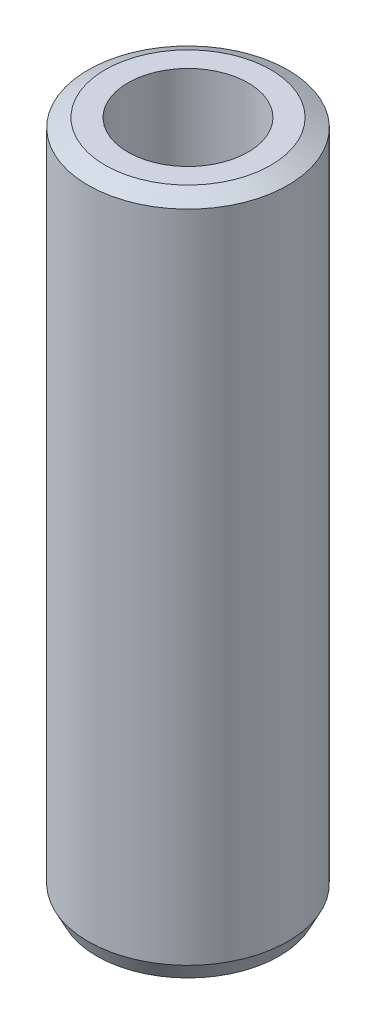
ISO-10303-21;
HEADER;
FILE_DESCRIPTION(('STEP AP214'),'2;1');
FILE_NAME('part.step','',(''),(''),'','','');
FILE_SCHEMA(('AUTOMOTIVE_DESIGN { 1 0 10303 214 1 1 1 1 }'));
ENDSEC;
DATA;
#1=APPLICATION_CONTEXT('core data for automotive mechanical design processes');
#2=APPLICATION_PROTOCOL_DEFINITION('international standard','automotive_design',2000,#1);
#3=PRODUCT_CONTEXT('',#1,'mechanical');
#4=PRODUCT('Part','Part','',(#3));
#5=PRODUCT_RELATED_PRODUCT_CATEGORY('part','',(#4));
#6=PRODUCT_DEFINITION_FORMATION('','',#4);
#7=PRODUCT_DEFINITION_CONTEXT('part definition',#1,'design');
#8=PRODUCT_DEFINITION('design','',#6,#7);
#9=PRODUCT_DEFINITION_SHAPE('','',#8);
#10=(LENGTH_UNIT() NAMED_UNIT(*) SI_UNIT(.MILLI.,.METRE.));
#11=(NAMED_UNIT(*) PLANE_ANGLE_UNIT() SI_UNIT($,.RADIAN.));
#12=(NAMED_UNIT(*) SI_UNIT($,.STERADIAN.) SOLID_ANGLE_UNIT());
#13=UNCERTAINTY_MEASURE_WITH_UNIT(LENGTH_MEASURE(1.E-05),#10,'distance_accuracy_value','');
#14=(GEOMETRIC_REPRESENTATION_CONTEXT(3) GLOBAL_UNCERTAINTY_ASSIGNED_CONTEXT((#13)) GLOBAL_UNIT_ASSIGNED_CONTEXT((#10,
#11,#12)) REPRESENTATION_CONTEXT('',''));
#15=CARTESIAN_POINT('',(0.,0.,0.));
#16=DIRECTION('',(0.,0.,1.));
#17=DIRECTION('',(1.,0.,0.));
#18=AXIS2_PLACEMENT_3D('',#15,#16,#17);
#19=CARTESIAN_POINT('',(0.,289.523709408753,0.));
#20=DIRECTION('',(0.,-1.,0.));
#21=DIRECTION('',(0.,0.,-1.));
#22=AXIS2_PLACEMENT_3D('',#19,#20,#21);
#23=CYLINDRICAL_SURFACE('',#22,42.5);
#24=CARTESIAN_POINT('',(0.,285.805268945542,0.));
#25=DIRECTION('',(0.,1.,0.));
#26=DIRECTION('',(0.,0.,1.));
#27=AXIS2_PLACEMENT_3D('',#24,#25,#26);
#28=CIRCLE('',#27,42.5);
#29=CARTESIAN_POINT('',(0.,285.805268945542,42.5));
#30=VERTEX_POINT('',#29);
#31=EDGE_CURVE('E50',#30,#30,#28,.F.);
#32=ORIENTED_EDGE('',*,*,#31,.T.);
#33=EDGE_LOOP('',(#32));
#34=FACE_BOUND('',#33,.T.);
#35=CARTESIAN_POINT('',(0.,7.27764263783459,0.));
#36=DIRECTION('',(0.,1.,0.));
#37=DIRECTION('',(0.,0.,1.));
#38=AXIS2_PLACEMENT_3D('',#35,#36,#37);
#39=CIRCLE('',#38,42.5);
#40=CARTESIAN_POINT('',(0.,7.27764263783459,42.5));
#41=VERTEX_POINT('',#40);
#42=EDGE_CURVE('E51',#41,#41,#39,.T.);
#43=ORIENTED_EDGE('',*,*,#42,.T.);
#44=EDGE_LOOP('',(#43));
#45=FACE_BOUND('',#44,.T.);
#46=ADVANCED_FACE('F39',(#34,#45),#23,.T.);
#47=CARTESIAN_POINT('',(0.,289.523709408753,0.));
#48=DIRECTION('',(0.,1.,0.));
#49=DIRECTION('',(0.,0.,1.));
#50=AXIS2_PLACEMENT_3D('',#47,#48,#49);
#51=PLANE('',#50);
#52=CARTESIAN_POINT('',(0.,289.523709408753,0.));
#53=DIRECTION('',(0.,1.,0.));
#54=DIRECTION('',(0.,0.,1.));
#55=AXIS2_PLACEMENT_3D('',#52,#53,#54);
#56=CIRCLE('',#55,35.2223573621654);
#57=CARTESIAN_POINT('',(0.,289.523709408753,35.2223573621654));
#58=VERTEX_POINT('',#57);
#59=EDGE_CURVE('E54',#58,#58,#56,.T.);
#60=ORIENTED_EDGE('',*,*,#59,.T.);
#61=EDGE_LOOP('',(#60));
#62=FACE_BOUND('',#61,.T.);
#63=CARTESIAN_POINT('',(0.,289.523709408753,0.));
#64=DIRECTION('',(0.,1.,0.));
#65=DIRECTION('',(0.,0.,1.));
#66=AXIS2_PLACEMENT_3D('',#63,#64,#65);
#67=CIRCLE('',#66,25.5556253756928);
#68=CARTESIAN_POINT('',(0.,289.523709408753,25.5556253756928));
#69=VERTEX_POINT('',#68);
#70=EDGE_CURVE('E58',#69,#69,#67,.T.);
#71=ORIENTED_EDGE('',*,*,#70,.F.);
#72=EDGE_LOOP('',(#71));
#73=FACE_BOUND('',#72,.T.);
#74=ADVANCED_FACE('F69',(#62,#73),#51,.T.);
#75=CARTESIAN_POINT('',(0.,0.,0.));
#76=DIRECTION('',(0.,1.,0.));
#77=DIRECTION('',(0.,0.,1.));
#78=AXIS2_PLACEMENT_3D('',#75,#76,#77);
#79=PLANE('',#78);
#80=CARTESIAN_POINT('',(0.,0.,0.));
#81=DIRECTION('',(0.,1.,0.));
#82=DIRECTION('',(0.,0.,1.));
#83=AXIS2_PLACEMENT_3D('',#80,#81,#82);
#84=CIRCLE('',#83,38.781559536789);
#85=CARTESIAN_POINT('',(0.,0.,38.781559536789));
#86=VERTEX_POINT('',#85);
#87=EDGE_CURVE('E10',#86,#86,#84,.F.);
#88=ORIENTED_EDGE('',*,*,#87,.T.);
#89=EDGE_LOOP('',(#88));
#90=FACE_BOUND('',#89,.T.);
#91=CARTESIAN_POINT('',(0.,0.,0.));
#92=DIRECTION('',(0.,1.,0.));
#93=DIRECTION('',(0.,0.,1.));
#94=AXIS2_PLACEMENT_3D('',#91,#92,#93);
#95=CIRCLE('',#94,25.5556253756928);
#96=CARTESIAN_POINT('',(0.,0.,25.5556253756928));
#97=VERTEX_POINT('',#96);
#98=EDGE_CURVE('E63',#97,#97,#95,.T.);
#99=ORIENTED_EDGE('',*,*,#98,.T.);
#100=EDGE_LOOP('',(#99));
#101=FACE_BOUND('',#100,.T.);
#102=ADVANCED_FACE('F75',(#90,#101),#79,.F.);
#103=CARTESIAN_POINT('',(0.,289.523709408753,0.));
#104=DIRECTION('',(0.,-1.,0.));
#105=DIRECTION('',(0.,0.,-1.));
#106=AXIS2_PLACEMENT_3D('',#103,#104,#105);
#107=CYLINDRICAL_SURFACE('',#106,25.5556253756928);
#108=ORIENTED_EDGE('',*,*,#70,.T.);
#109=EDGE_LOOP('',(#108));
#110=FACE_BOUND('',#109,.T.);
#111=ORIENTED_EDGE('',*,*,#98,.F.);
#112=EDGE_LOOP('',(#111));
#113=FACE_BOUND('',#112,.T.);
#114=ADVANCED_FACE('F70',(#110,#113),#107,.F.);
#115=CARTESIAN_POINT('',(0.,289.523709408753,0.));
#116=DIRECTION('',(0.,-1.,0.));
#117=DIRECTION('',(0.,0.,-1.));
#118=AXIS2_PLACEMENT_3D('',#115,#116,#117);
#119=CONICAL_SURFACE('',#118,35.2223573621654,1.09843488130168);
#120=ORIENTED_EDGE('',*,*,#31,.F.);
#121=EDGE_LOOP('',(#120));
#122=FACE_BOUND('',#121,.T.);
#123=ORIENTED_EDGE('',*,*,#59,.F.);
#124=EDGE_LOOP('',(#123));
#125=FACE_BOUND('',#124,.T.);
#126=ADVANCED_FACE('F81',(#122,#125),#119,.T.);
#127=CARTESIAN_POINT('',(0.,7.27764263783459,0.));
#128=DIRECTION('',(0.,1.,0.));
#129=DIRECTION('',(0.,0.,1.));
#130=AXIS2_PLACEMENT_3D('',#127,#128,#129);
#131=CONICAL_SURFACE('',#130,42.5,0.472361445493214);
#132=ORIENTED_EDGE('',*,*,#87,.F.);
#133=EDGE_LOOP('',(#132));
#134=FACE_BOUND('',#133,.T.);
#135=ORIENTED_EDGE('',*,*,#42,.F.);
#136=EDGE_LOOP('',(#135));
#137=FACE_BOUND('',#136,.T.);
#138=ADVANCED_FACE('F45',(#134,#137),#131,.T.);
#139=CLOSED_SHELL('',(#46,#74,#102,#114,#126,#138));
#140=MANIFOLD_SOLID_BREP('B2',#139);
#141=ADVANCED_BREP_SHAPE_REPRESENTATION('',(#18,#140),#14);
#142=SHAPE_DEFINITION_REPRESENTATION(#9,#141);
ENDSEC;
END-ISO-10303-21;
